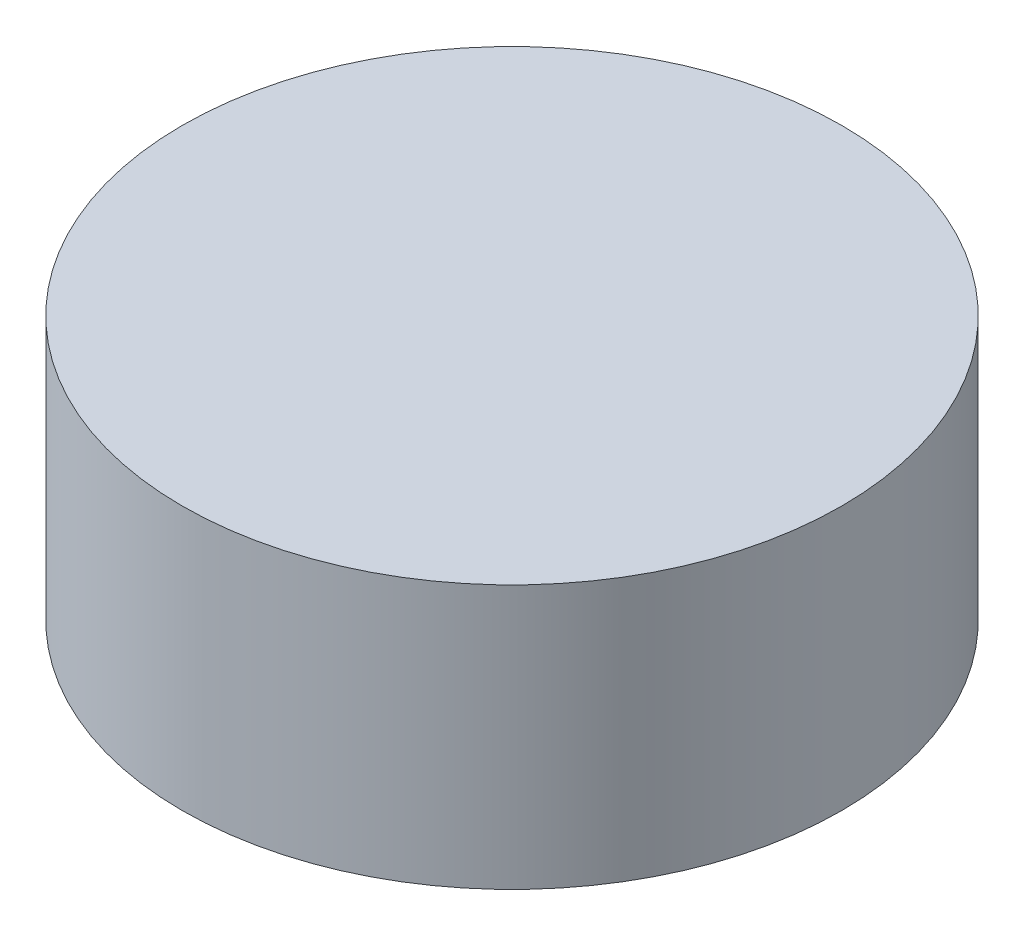
ISO-10303-21;
HEADER;
FILE_DESCRIPTION(('STEP AP214'),'2;1');
FILE_NAME('part.step','',(''),(''),'','','');
FILE_SCHEMA(('AUTOMOTIVE_DESIGN { 1 0 10303 214 1 1 1 1 }'));
ENDSEC;
DATA;
#1=APPLICATION_CONTEXT('core data for automotive mechanical design processes');
#2=APPLICATION_PROTOCOL_DEFINITION('international standard','automotive_design',2000,#1);
#3=PRODUCT_CONTEXT('',#1,'mechanical');
#4=PRODUCT('Part','Part','',(#3));
#5=PRODUCT_RELATED_PRODUCT_CATEGORY('part','',(#4));
#6=PRODUCT_DEFINITION_FORMATION('','',#4);
#7=PRODUCT_DEFINITION_CONTEXT('part definition',#1,'design');
#8=PRODUCT_DEFINITION('design','',#6,#7);
#9=PRODUCT_DEFINITION_SHAPE('','',#8);
#10=(LENGTH_UNIT() NAMED_UNIT(*) SI_UNIT(.MILLI.,.METRE.));
#11=(NAMED_UNIT(*) PLANE_ANGLE_UNIT() SI_UNIT($,.RADIAN.));
#12=(NAMED_UNIT(*) SI_UNIT($,.STERADIAN.) SOLID_ANGLE_UNIT());
#13=UNCERTAINTY_MEASURE_WITH_UNIT(LENGTH_MEASURE(1.E-05),#10,'distance_accuracy_value','');
#14=(GEOMETRIC_REPRESENTATION_CONTEXT(3) GLOBAL_UNCERTAINTY_ASSIGNED_CONTEXT((#13)) GLOBAL_UNIT_ASSIGNED_CONTEXT((#10,
#11,#12)) REPRESENTATION_CONTEXT('',''));
#15=CARTESIAN_POINT('',(0.,0.,0.));
#16=DIRECTION('',(0.,0.,1.));
#17=DIRECTION('',(1.,0.,0.));
#18=AXIS2_PLACEMENT_3D('',#15,#16,#17);
#19=CARTESIAN_POINT('',(0.,1.,0.));
#20=DIRECTION('',(0.,-1.,0.));
#21=DIRECTION('',(0.,0.,-1.));
#22=AXIS2_PLACEMENT_3D('',#19,#20,#21);
#23=CYLINDRICAL_SURFACE('',#22,1.25);
#24=CARTESIAN_POINT('',(0.,1.,0.));
#25=DIRECTION('',(0.,1.,0.));
#26=DIRECTION('',(0.,0.,1.));
#27=AXIS2_PLACEMENT_3D('',#24,#25,#26);
#28=CIRCLE('',#27,1.25);
#29=CARTESIAN_POINT('',(0.,1.,1.25));
#30=VERTEX_POINT('',#29);
#31=EDGE_CURVE('E10',#30,#30,#28,.T.);
#32=ORIENTED_EDGE('',*,*,#31,.F.);
#33=EDGE_LOOP('',(#32));
#34=FACE_BOUND('',#33,.T.);
#35=CARTESIAN_POINT('',(0.,0.,0.));
#36=DIRECTION('',(0.,1.,0.));
#37=DIRECTION('',(0.,0.,1.));
#38=AXIS2_PLACEMENT_3D('',#35,#36,#37);
#39=CIRCLE('',#38,1.25);
#40=CARTESIAN_POINT('',(0.,0.,1.25));
#41=VERTEX_POINT('',#40);
#42=EDGE_CURVE('E37',#41,#41,#39,.T.);
#43=ORIENTED_EDGE('',*,*,#42,.T.);
#44=EDGE_LOOP('',(#43));
#45=FACE_BOUND('',#44,.T.);
#46=ADVANCED_FACE('F34',(#34,#45),#23,.T.);
#47=CARTESIAN_POINT('',(0.,1.,0.));
#48=DIRECTION('',(0.,1.,0.));
#49=DIRECTION('',(0.,0.,1.));
#50=AXIS2_PLACEMENT_3D('',#47,#48,#49);
#51=PLANE('',#50);
#52=ORIENTED_EDGE('',*,*,#31,.T.);
#53=EDGE_LOOP('',(#52));
#54=FACE_BOUND('',#53,.T.);
#55=ADVANCED_FACE('F49',(#54),#51,.T.);
#56=CARTESIAN_POINT('',(0.,0.,0.));
#57=DIRECTION('',(0.,1.,0.));
#58=DIRECTION('',(0.,0.,1.));
#59=AXIS2_PLACEMENT_3D('',#56,#57,#58);
#60=PLANE('',#59);
#61=ORIENTED_EDGE('',*,*,#42,.F.);
#62=EDGE_LOOP('',(#61));
#63=FACE_BOUND('',#62,.T.);
#64=ADVANCED_FACE('F47',(#63),#60,.F.);
#65=CLOSED_SHELL('',(#46,#55,#64));
#66=MANIFOLD_SOLID_BREP('B2',#65);
#67=ADVANCED_BREP_SHAPE_REPRESENTATION('',(#18,#66),#14);
#68=SHAPE_DEFINITION_REPRESENTATION(#9,#67);
ENDSEC;
END-ISO-10303-21;
